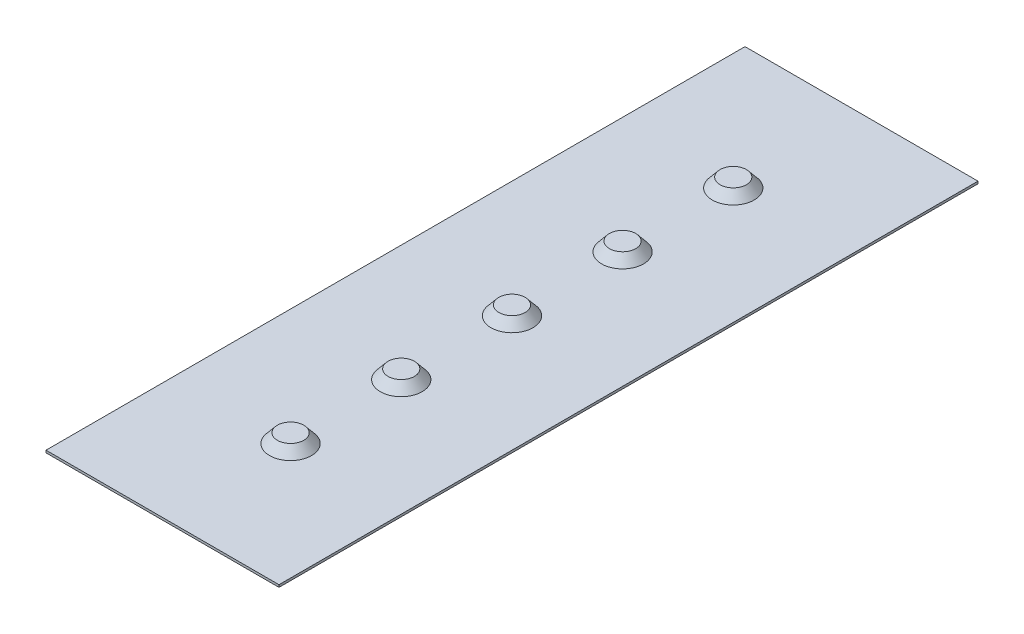
ISO-10303-21;
HEADER;
FILE_DESCRIPTION(('STEP AP214'),'2;1');
FILE_NAME('part.step','',(''),(''),'','','');
FILE_SCHEMA(('AUTOMOTIVE_DESIGN { 1 0 10303 214 1 1 1 1 }'));
ENDSEC;
DATA;
#1=APPLICATION_CONTEXT('core data for automotive mechanical design processes');
#2=APPLICATION_PROTOCOL_DEFINITION('international standard','automotive_design',2000,#1);
#3=PRODUCT_CONTEXT('',#1,'mechanical');
#4=PRODUCT('Part','Part','',(#3));
#5=PRODUCT_RELATED_PRODUCT_CATEGORY('part','',(#4));
#6=PRODUCT_DEFINITION_FORMATION('','',#4);
#7=PRODUCT_DEFINITION_CONTEXT('part definition',#1,'design');
#8=PRODUCT_DEFINITION('design','',#6,#7);
#9=PRODUCT_DEFINITION_SHAPE('','',#8);
#10=(LENGTH_UNIT() NAMED_UNIT(*) SI_UNIT(.MILLI.,.METRE.));
#11=(NAMED_UNIT(*) PLANE_ANGLE_UNIT() SI_UNIT($,.RADIAN.));
#12=(NAMED_UNIT(*) SI_UNIT($,.STERADIAN.) SOLID_ANGLE_UNIT());
#13=UNCERTAINTY_MEASURE_WITH_UNIT(LENGTH_MEASURE(1.E-05),#10,'distance_accuracy_value','');
#14=(GEOMETRIC_REPRESENTATION_CONTEXT(3) GLOBAL_UNCERTAINTY_ASSIGNED_CONTEXT((#13)) GLOBAL_UNIT_ASSIGNED_CONTEXT((#10,
#11,#12)) REPRESENTATION_CONTEXT('',''));
#15=CARTESIAN_POINT('',(0.,0.,0.));
#16=DIRECTION('',(0.,0.,1.));
#17=DIRECTION('',(1.,0.,0.));
#18=AXIS2_PLACEMENT_3D('',#15,#16,#17);
#19=CARTESIAN_POINT('',(191.055728090001,2.,-26.8328157299974));
#20=DIRECTION('',(-1.,0.,0.));
#21=DIRECTION('',(0.,0.,1.));
#22=AXIS2_PLACEMENT_3D('',#19,#20,#21);
#23=PLANE('',#22);
#24=DIRECTION('',(0.,0.,-1.));
#25=VECTOR('',#24,1.);
#26=CARTESIAN_POINT('',(191.055728090001,0.,-26.8328157299974));
#27=LINE('',#26,#25);
#28=CARTESIAN_POINT('',(191.055728090001,0.,573.167184270003));
#29=VERTEX_POINT('',#28);
#30=CARTESIAN_POINT('',(191.055728090001,0.,-26.8328157299974));
#31=VERTEX_POINT('',#30);
#32=EDGE_CURVE('E107',#29,#31,#27,.T.);
#33=ORIENTED_EDGE('',*,*,#32,.T.);
#34=DIRECTION('',(0.,-1.,0.));
#35=VECTOR('',#34,1.);
#36=CARTESIAN_POINT('',(191.055728090001,2.,-26.8328157299974));
#37=LINE('',#36,#35);
#38=CARTESIAN_POINT('',(191.055728090001,2.,-26.8328157299974));
#39=VERTEX_POINT('',#38);
#40=EDGE_CURVE('E12',#39,#31,#37,.T.);
#41=ORIENTED_EDGE('',*,*,#40,.F.);
#42=DIRECTION('',(0.,0.,-1.));
#43=VECTOR('',#42,1.);
#44=CARTESIAN_POINT('',(191.055728090001,2.,-26.8328157299974));
#45=LINE('',#44,#43);
#46=CARTESIAN_POINT('',(191.055728090001,2.,573.167184270003));
#47=VERTEX_POINT('',#46);
#48=EDGE_CURVE('E95',#47,#39,#45,.T.);
#49=ORIENTED_EDGE('',*,*,#48,.F.);
#50=DIRECTION('',(0.,-1.,0.));
#51=VECTOR('',#50,1.);
#52=CARTESIAN_POINT('',(191.055728090001,2.,573.167184270003));
#53=LINE('',#52,#51);
#54=EDGE_CURVE('E103',#47,#29,#53,.T.);
#55=ORIENTED_EDGE('',*,*,#54,.T.);
#56=EDGE_LOOP('',(#33,#41,#49,#55));
#57=FACE_BOUND('',#56,.T.);
#58=ADVANCED_FACE('F44',(#57),#23,.F.);
#59=CARTESIAN_POINT('',(-8.94427190999917,2.,-26.8328157299974));
#60=DIRECTION('',(0.,0.,1.));
#61=DIRECTION('',(1.,0.,0.));
#62=AXIS2_PLACEMENT_3D('',#59,#60,#61);
#63=PLANE('',#62);
#64=DIRECTION('',(-1.,0.,0.));
#65=VECTOR('',#64,1.);
#66=CARTESIAN_POINT('',(-8.94427190999917,0.,-26.8328157299974));
#67=LINE('',#66,#65);
#68=CARTESIAN_POINT('',(-8.94427190999917,0.,-26.8328157299974));
#69=VERTEX_POINT('',#68);
#70=EDGE_CURVE('E99',#31,#69,#67,.T.);
#71=ORIENTED_EDGE('',*,*,#70,.T.);
#72=DIRECTION('',(0.,-1.,0.));
#73=VECTOR('',#72,1.);
#74=CARTESIAN_POINT('',(-8.94427190999917,2.,-26.8328157299974));
#75=LINE('',#74,#73);
#76=CARTESIAN_POINT('',(-8.94427190999917,2.,-26.8328157299974));
#77=VERTEX_POINT('',#76);
#78=EDGE_CURVE('E52',#77,#69,#75,.T.);
#79=ORIENTED_EDGE('',*,*,#78,.F.);
#80=DIRECTION('',(-1.,0.,0.));
#81=VECTOR('',#80,1.);
#82=CARTESIAN_POINT('',(-8.94427190999917,2.,-26.8328157299974));
#83=LINE('',#82,#81);
#84=EDGE_CURVE('E90',#39,#77,#83,.T.);
#85=ORIENTED_EDGE('',*,*,#84,.F.);
#86=ORIENTED_EDGE('',*,*,#40,.T.);
#87=EDGE_LOOP('',(#71,#79,#85,#86));
#88=FACE_BOUND('',#87,.T.);
#89=ADVANCED_FACE('F98',(#88),#63,.F.);
#90=CARTESIAN_POINT('',(-8.94427190999917,2.,-26.8328157299974));
#91=DIRECTION('',(1.,0.,0.));
#92=DIRECTION('',(0.,0.,-1.));
#93=AXIS2_PLACEMENT_3D('',#90,#91,#92);
#94=PLANE('',#93);
#95=DIRECTION('',(0.,0.,1.));
#96=VECTOR('',#95,1.);
#97=CARTESIAN_POINT('',(-8.94427190999917,0.,-26.8328157299974));
#98=LINE('',#97,#96);
#99=CARTESIAN_POINT('',(-8.94427190999912,0.,573.167184270003));
#100=VERTEX_POINT('',#99);
#101=EDGE_CURVE('E77',#69,#100,#98,.T.);
#102=ORIENTED_EDGE('',*,*,#101,.T.);
#103=DIRECTION('',(0.,-1.,0.));
#104=VECTOR('',#103,1.);
#105=CARTESIAN_POINT('',(-8.94427190999912,2.,573.167184270003));
#106=LINE('',#105,#104);
#107=CARTESIAN_POINT('',(-8.94427190999912,2.,573.167184270003));
#108=VERTEX_POINT('',#107);
#109=EDGE_CURVE('E100',#108,#100,#106,.T.);
#110=ORIENTED_EDGE('',*,*,#109,.F.);
#111=DIRECTION('',(0.,0.,1.));
#112=VECTOR('',#111,1.);
#113=CARTESIAN_POINT('',(-8.94427190999917,2.,-26.8328157299974));
#114=LINE('',#113,#112);
#115=EDGE_CURVE('E93',#77,#108,#114,.T.);
#116=ORIENTED_EDGE('',*,*,#115,.F.);
#117=ORIENTED_EDGE('',*,*,#78,.T.);
#118=EDGE_LOOP('',(#102,#110,#116,#117));
#119=FACE_BOUND('',#118,.T.);
#120=ADVANCED_FACE('F101',(#119),#94,.F.);
#121=CARTESIAN_POINT('',(-8.94427190999912,2.,573.167184270003));
#122=DIRECTION('',(0.,0.,-1.));
#123=DIRECTION('',(-1.,0.,0.));
#124=AXIS2_PLACEMENT_3D('',#121,#122,#123);
#125=PLANE('',#124);
#126=DIRECTION('',(1.,0.,0.));
#127=VECTOR('',#126,1.);
#128=CARTESIAN_POINT('',(-8.94427190999912,0.,573.167184270003));
#129=LINE('',#128,#127);
#130=EDGE_CURVE('E83',#100,#29,#129,.T.);
#131=ORIENTED_EDGE('',*,*,#130,.T.);
#132=ORIENTED_EDGE('',*,*,#54,.F.);
#133=DIRECTION('',(1.,0.,0.));
#134=VECTOR('',#133,1.);
#135=CARTESIAN_POINT('',(-8.94427190999912,2.,573.167184270003));
#136=LINE('',#135,#134);
#137=EDGE_CURVE('E60',#108,#47,#136,.T.);
#138=ORIENTED_EDGE('',*,*,#137,.F.);
#139=ORIENTED_EDGE('',*,*,#109,.T.);
#140=EDGE_LOOP('',(#131,#132,#138,#139));
#141=FACE_BOUND('',#140,.T.);
#142=ADVANCED_FACE('F115',(#141),#125,.F.);
#143=CARTESIAN_POINT('',(0.,2.,0.));
#144=DIRECTION('',(0.,1.,0.));
#145=DIRECTION('',(0.,0.,1.));
#146=AXIS2_PLACEMENT_3D('',#143,#144,#145);
#147=PLANE('',#146);
#148=CARTESIAN_POINT('',(91.0557280900009,2.,463.246549225458));
#149=DIRECTION('',(0.,1.,0.));
#150=DIRECTION('',(0.,0.,1.));
#151=AXIS2_PLACEMENT_3D('',#148,#149,#150);
#152=CIRCLE('',#151,18.);
#153=CARTESIAN_POINT('',(91.0557280900009,2.,481.246549225458));
#154=VERTEX_POINT('',#153);
#155=EDGE_CURVE('E144',#154,#154,#152,.T.);
#156=ORIENTED_EDGE('',*,*,#155,.F.);
#157=EDGE_LOOP('',(#156));
#158=FACE_BOUND('',#157,.T.);
#159=CARTESIAN_POINT('',(91.0557280900009,2.,368.246549225458));
#160=DIRECTION('',(0.,1.,0.));
#161=DIRECTION('',(0.,0.,1.));
#162=AXIS2_PLACEMENT_3D('',#159,#160,#161);
#163=CIRCLE('',#162,18.);
#164=CARTESIAN_POINT('',(91.0557280900009,2.,386.246549225458));
#165=VERTEX_POINT('',#164);
#166=EDGE_CURVE('E138',#165,#165,#163,.T.);
#167=ORIENTED_EDGE('',*,*,#166,.F.);
#168=EDGE_LOOP('',(#167));
#169=FACE_BOUND('',#168,.T.);
#170=CARTESIAN_POINT('',(91.0557280900008,2.,273.167184270003));
#171=DIRECTION('',(0.,1.,0.));
#172=DIRECTION('',(0.,0.,1.));
#173=AXIS2_PLACEMENT_3D('',#170,#171,#172);
#174=CIRCLE('',#173,18.);
#175=CARTESIAN_POINT('',(91.0557280900008,2.,291.167184270003));
#176=VERTEX_POINT('',#175);
#177=EDGE_CURVE('E132',#176,#176,#174,.T.);
#178=ORIENTED_EDGE('',*,*,#177,.F.);
#179=EDGE_LOOP('',(#178));
#180=FACE_BOUND('',#179,.T.);
#181=CARTESIAN_POINT('',(91.0557280900009,2.,178.246549225458));
#182=DIRECTION('',(0.,1.,0.));
#183=DIRECTION('',(0.,0.,1.));
#184=AXIS2_PLACEMENT_3D('',#181,#182,#183);
#185=CIRCLE('',#184,18.);
#186=CARTESIAN_POINT('',(91.0557280900009,2.,196.246549225458));
#187=VERTEX_POINT('',#186);
#188=EDGE_CURVE('E126',#187,#187,#185,.T.);
#189=ORIENTED_EDGE('',*,*,#188,.F.);
#190=EDGE_LOOP('',(#189));
#191=FACE_BOUND('',#190,.T.);
#192=CARTESIAN_POINT('',(91.0557280900009,2.,83.246549225458));
#193=DIRECTION('',(0.,1.,0.));
#194=DIRECTION('',(0.,0.,1.));
#195=AXIS2_PLACEMENT_3D('',#192,#193,#194);
#196=CIRCLE('',#195,18.);
#197=CARTESIAN_POINT('',(91.0557280900009,2.,101.246549225458));
#198=VERTEX_POINT('',#197);
#199=EDGE_CURVE('E123',#198,#198,#196,.T.);
#200=ORIENTED_EDGE('',*,*,#199,.F.);
#201=EDGE_LOOP('',(#200));
#202=FACE_BOUND('',#201,.T.);
#203=ORIENTED_EDGE('',*,*,#48,.T.);
#204=ORIENTED_EDGE('',*,*,#84,.T.);
#205=ORIENTED_EDGE('',*,*,#115,.T.);
#206=ORIENTED_EDGE('',*,*,#137,.T.);
#207=EDGE_LOOP('',(#203,#204,#205,#206));
#208=FACE_BOUND('',#207,.T.);
#209=ADVANCED_FACE('F91',(#158,#169,#180,#191,#202,#208),#147,.T.);
#210=CARTESIAN_POINT('',(0.,0.,0.));
#211=DIRECTION('',(0.,1.,0.));
#212=DIRECTION('',(0.,0.,1.));
#213=AXIS2_PLACEMENT_3D('',#210,#211,#212);
#214=PLANE('',#213);
#215=ORIENTED_EDGE('',*,*,#32,.F.);
#216=ORIENTED_EDGE('',*,*,#130,.F.);
#217=ORIENTED_EDGE('',*,*,#101,.F.);
#218=ORIENTED_EDGE('',*,*,#70,.F.);
#219=EDGE_LOOP('',(#215,#216,#217,#218));
#220=FACE_BOUND('',#219,.T.);
#221=ADVANCED_FACE('F118',(#220),#214,.F.);
#222=CARTESIAN_POINT('',(91.0557280900009,2.,83.246549225458));
#223=DIRECTION('',(0.,-1.,0.));
#224=DIRECTION('',(0.,0.,1.));
#225=AXIS2_PLACEMENT_3D('',#222,#223,#224);
#226=CONICAL_SURFACE('',#225,18.,0.698131700797733);
#227=CARTESIAN_POINT('',(91.0557280900009,10.,83.246549225458));
#228=DIRECTION('',(0.,1.,0.));
#229=DIRECTION('',(0.,0.,1.));
#230=AXIS2_PLACEMENT_3D('',#227,#228,#229);
#231=CIRCLE('',#230,11.2872029505817);
#232=CARTESIAN_POINT('',(91.0557280900009,10.,94.5337521760397));
#233=VERTEX_POINT('',#232);
#234=EDGE_CURVE('E110',#233,#233,#231,.T.);
#235=ORIENTED_EDGE('',*,*,#234,.F.);
#236=EDGE_LOOP('',(#235));
#237=FACE_BOUND('',#236,.T.);
#238=ORIENTED_EDGE('',*,*,#199,.T.);
#239=EDGE_LOOP('',(#238));
#240=FACE_BOUND('',#239,.T.);
#241=ADVANCED_FACE('F171',(#237,#240),#226,.T.);
#242=CARTESIAN_POINT('',(91.0557280900009,10.,83.246549225458));
#243=DIRECTION('',(0.,1.,0.));
#244=DIRECTION('',(0.,0.,1.));
#245=AXIS2_PLACEMENT_3D('',#242,#243,#244);
#246=PLANE('',#245);
#247=ORIENTED_EDGE('',*,*,#234,.T.);
#248=EDGE_LOOP('',(#247));
#249=FACE_BOUND('',#248,.T.);
#250=ADVANCED_FACE('F173',(#249),#246,.T.);
#251=CARTESIAN_POINT('',(91.0557280900009,2.,178.246549225458));
#252=DIRECTION('',(0.,-1.,0.));
#253=DIRECTION('',(0.,0.,1.));
#254=AXIS2_PLACEMENT_3D('',#251,#252,#253);
#255=CONICAL_SURFACE('',#254,18.,0.698131700797733);
#256=CARTESIAN_POINT('',(91.0557280900009,10.,178.246549225458));
#257=DIRECTION('',(0.,1.,0.));
#258=DIRECTION('',(0.,0.,1.));
#259=AXIS2_PLACEMENT_3D('',#256,#257,#258);
#260=CIRCLE('',#259,11.2872029505817);
#261=CARTESIAN_POINT('',(91.0557280900009,10.,189.53375217604));
#262=VERTEX_POINT('',#261);
#263=EDGE_CURVE('E129',#262,#262,#260,.T.);
#264=ORIENTED_EDGE('',*,*,#263,.F.);
#265=EDGE_LOOP('',(#264));
#266=FACE_BOUND('',#265,.T.);
#267=ORIENTED_EDGE('',*,*,#188,.T.);
#268=EDGE_LOOP('',(#267));
#269=FACE_BOUND('',#268,.T.);
#270=ADVANCED_FACE('F180',(#266,#269),#255,.T.);
#271=CARTESIAN_POINT('',(91.0557280900009,10.,178.246549225458));
#272=DIRECTION('',(0.,1.,0.));
#273=DIRECTION('',(0.,0.,1.));
#274=AXIS2_PLACEMENT_3D('',#271,#272,#273);
#275=PLANE('',#274);
#276=ORIENTED_EDGE('',*,*,#263,.T.);
#277=EDGE_LOOP('',(#276));
#278=FACE_BOUND('',#277,.T.);
#279=ADVANCED_FACE('F243',(#278),#275,.T.);
#280=CARTESIAN_POINT('',(91.0557280900008,2.,273.167184270003));
#281=DIRECTION('',(0.,-1.,0.));
#282=DIRECTION('',(0.,0.,1.));
#283=AXIS2_PLACEMENT_3D('',#280,#281,#282);
#284=CONICAL_SURFACE('',#283,18.,0.698131700797733);
#285=CARTESIAN_POINT('',(91.0557280900008,10.,273.167184270003));
#286=DIRECTION('',(0.,1.,0.));
#287=DIRECTION('',(0.,0.,1.));
#288=AXIS2_PLACEMENT_3D('',#285,#286,#287);
#289=CIRCLE('',#288,11.2872029505818);
#290=CARTESIAN_POINT('',(91.0557280900008,10.,284.454387220584));
#291=VERTEX_POINT('',#290);
#292=EDGE_CURVE('E135',#291,#291,#289,.T.);
#293=ORIENTED_EDGE('',*,*,#292,.F.);
#294=EDGE_LOOP('',(#293));
#295=FACE_BOUND('',#294,.T.);
#296=ORIENTED_EDGE('',*,*,#177,.T.);
#297=EDGE_LOOP('',(#296));
#298=FACE_BOUND('',#297,.T.);
#299=ADVANCED_FACE('F255',(#295,#298),#284,.T.);
#300=CARTESIAN_POINT('',(91.0557280900008,10.,273.167184270003));
#301=DIRECTION('',(0.,1.,0.));
#302=DIRECTION('',(0.,0.,1.));
#303=AXIS2_PLACEMENT_3D('',#300,#301,#302);
#304=PLANE('',#303);
#305=ORIENTED_EDGE('',*,*,#292,.T.);
#306=EDGE_LOOP('',(#305));
#307=FACE_BOUND('',#306,.T.);
#308=ADVANCED_FACE('F267',(#307),#304,.T.);
#309=CARTESIAN_POINT('',(91.0557280900009,2.,368.246549225458));
#310=DIRECTION('',(0.,-1.,0.));
#311=DIRECTION('',(0.,0.,1.));
#312=AXIS2_PLACEMENT_3D('',#309,#310,#311);
#313=CONICAL_SURFACE('',#312,18.,0.698131700797733);
#314=CARTESIAN_POINT('',(91.0557280900009,10.,368.246549225458));
#315=DIRECTION('',(0.,1.,0.));
#316=DIRECTION('',(0.,0.,1.));
#317=AXIS2_PLACEMENT_3D('',#314,#315,#316);
#318=CIRCLE('',#317,11.2872029505818);
#319=CARTESIAN_POINT('',(91.0557280900009,10.,379.53375217604));
#320=VERTEX_POINT('',#319);
#321=EDGE_CURVE('E141',#320,#320,#318,.T.);
#322=ORIENTED_EDGE('',*,*,#321,.F.);
#323=EDGE_LOOP('',(#322));
#324=FACE_BOUND('',#323,.T.);
#325=ORIENTED_EDGE('',*,*,#166,.T.);
#326=EDGE_LOOP('',(#325));
#327=FACE_BOUND('',#326,.T.);
#328=ADVANCED_FACE('F279',(#324,#327),#313,.T.);
#329=CARTESIAN_POINT('',(91.0557280900009,10.,368.246549225458));
#330=DIRECTION('',(0.,1.,0.));
#331=DIRECTION('',(0.,0.,1.));
#332=AXIS2_PLACEMENT_3D('',#329,#330,#331);
#333=PLANE('',#332);
#334=ORIENTED_EDGE('',*,*,#321,.T.);
#335=EDGE_LOOP('',(#334));
#336=FACE_BOUND('',#335,.T.);
#337=ADVANCED_FACE('F156',(#336),#333,.T.);
#338=CARTESIAN_POINT('',(91.0557280900009,2.,463.246549225458));
#339=DIRECTION('',(0.,-1.,0.));
#340=DIRECTION('',(0.,0.,1.));
#341=AXIS2_PLACEMENT_3D('',#338,#339,#340);
#342=CONICAL_SURFACE('',#341,18.,0.698131700797733);
#343=CARTESIAN_POINT('',(91.0557280900009,10.,463.246549225458));
#344=DIRECTION('',(0.,1.,0.));
#345=DIRECTION('',(0.,0.,1.));
#346=AXIS2_PLACEMENT_3D('',#343,#344,#345);
#347=CIRCLE('',#346,11.2872029505818);
#348=CARTESIAN_POINT('',(91.0557280900009,10.,474.53375217604));
#349=VERTEX_POINT('',#348);
#350=EDGE_CURVE('E147',#349,#349,#347,.T.);
#351=ORIENTED_EDGE('',*,*,#350,.F.);
#352=EDGE_LOOP('',(#351));
#353=FACE_BOUND('',#352,.T.);
#354=ORIENTED_EDGE('',*,*,#155,.T.);
#355=EDGE_LOOP('',(#354));
#356=FACE_BOUND('',#355,.T.);
#357=ADVANCED_FACE('F153',(#353,#356),#342,.T.);
#358=CARTESIAN_POINT('',(91.0557280900009,10.,463.246549225458));
#359=DIRECTION('',(0.,1.,0.));
#360=DIRECTION('',(0.,0.,1.));
#361=AXIS2_PLACEMENT_3D('',#358,#359,#360);
#362=PLANE('',#361);
#363=ORIENTED_EDGE('',*,*,#350,.T.);
#364=EDGE_LOOP('',(#363));
#365=FACE_BOUND('',#364,.T.);
#366=ADVANCED_FACE('F151',(#365),#362,.T.);
#367=CLOSED_SHELL('',(#58,#89,#120,#142,#209,#221,#241,#250,#270,#279,#299,#308,#328,#337,#357,#366));
#368=MANIFOLD_SOLID_BREP('B2',#367);
#369=ADVANCED_BREP_SHAPE_REPRESENTATION('',(#18,#368),#14);
#370=SHAPE_DEFINITION_REPRESENTATION(#9,#369);
ENDSEC;
END-ISO-10303-21;
